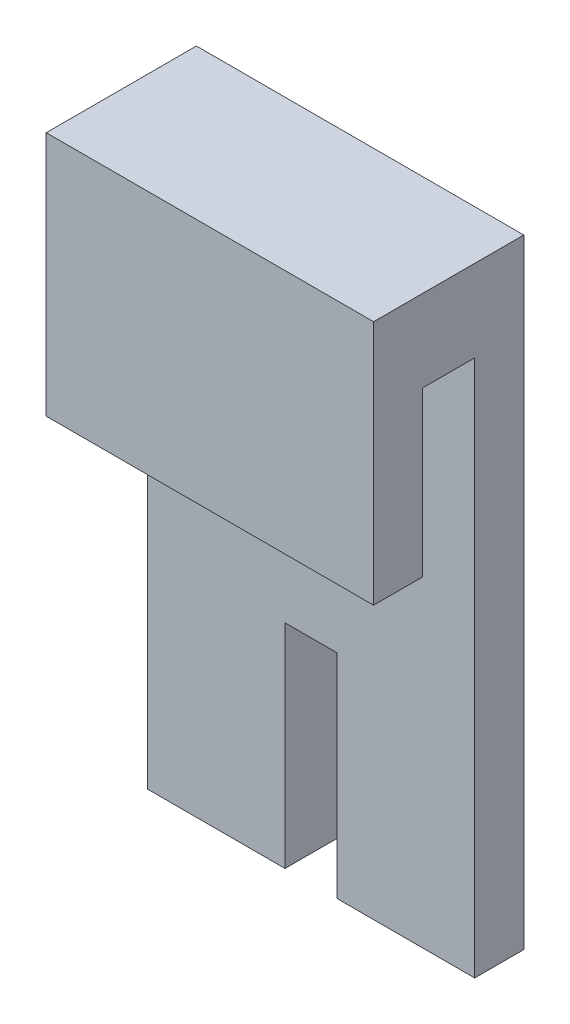
ISO-10303-21;
HEADER;
FILE_DESCRIPTION(('STEP AP214'),'2;1');
FILE_NAME('part.step','',(''),(''),'','','');
FILE_SCHEMA(('AUTOMOTIVE_DESIGN { 1 0 10303 214 1 1 1 1 }'));
ENDSEC;
DATA;
#1=APPLICATION_CONTEXT('core data for automotive mechanical design processes');
#2=APPLICATION_PROTOCOL_DEFINITION('international standard','automotive_design',2000,#1);
#3=PRODUCT_CONTEXT('',#1,'mechanical');
#4=PRODUCT('Part','Part','',(#3));
#5=PRODUCT_RELATED_PRODUCT_CATEGORY('part','',(#4));
#6=PRODUCT_DEFINITION_FORMATION('','',#4);
#7=PRODUCT_DEFINITION_CONTEXT('part definition',#1,'design');
#8=PRODUCT_DEFINITION('design','',#6,#7);
#9=PRODUCT_DEFINITION_SHAPE('','',#8);
#10=(LENGTH_UNIT() NAMED_UNIT(*) SI_UNIT(.MILLI.,.METRE.));
#11=(NAMED_UNIT(*) PLANE_ANGLE_UNIT() SI_UNIT($,.RADIAN.));
#12=(NAMED_UNIT(*) SI_UNIT($,.STERADIAN.) SOLID_ANGLE_UNIT());
#13=UNCERTAINTY_MEASURE_WITH_UNIT(LENGTH_MEASURE(1.E-05),#10,'distance_accuracy_value','');
#14=(GEOMETRIC_REPRESENTATION_CONTEXT(3) GLOBAL_UNCERTAINTY_ASSIGNED_CONTEXT((#13)) GLOBAL_UNIT_ASSIGNED_CONTEXT((#10,
#11,#12)) REPRESENTATION_CONTEXT('',''));
#15=CARTESIAN_POINT('',(0.,0.,0.));
#16=DIRECTION('',(0.,0.,1.));
#17=DIRECTION('',(1.,0.,0.));
#18=AXIS2_PLACEMENT_3D('',#15,#16,#17);
#19=CARTESIAN_POINT('',(20.,-22.812,-6.17500000000001));
#20=DIRECTION('',(0.,1.,0.));
#21=DIRECTION('',(0.,0.,1.));
#22=AXIS2_PLACEMENT_3D('',#19,#20,#21);
#23=PLANE('',#22);
#24=DIRECTION('',(0.,0.,1.));
#25=VECTOR('',#24,1.);
#26=CARTESIAN_POINT('',(8.4125,-22.812,-14.175));
#27=LINE('',#26,#25);
#28=CARTESIAN_POINT('',(8.4125,-22.812,-14.175));
#29=VERTEX_POINT('',#28);
#30=CARTESIAN_POINT('',(8.4125,-22.812,-6.17500000000001));
#31=VERTEX_POINT('',#30);
#32=EDGE_CURVE('E257',#29,#31,#27,.T.);
#33=ORIENTED_EDGE('',*,*,#32,.T.);
#34=DIRECTION('',(-1.,0.,0.));
#35=VECTOR('',#34,1.);
#36=CARTESIAN_POINT('',(20.,-22.812,-6.17500000000001));
#37=LINE('',#36,#35);
#38=CARTESIAN_POINT('',(0.,-22.812,-6.17500000000001));
#39=VERTEX_POINT('',#38);
#40=EDGE_CURVE('E176',#31,#39,#37,.T.);
#41=ORIENTED_EDGE('',*,*,#40,.T.);
#42=DIRECTION('',(0.,0.,-1.));
#43=VECTOR('',#42,1.);
#44=CARTESIAN_POINT('',(0.,-22.812,-6.17500000000001));
#45=LINE('',#44,#43);
#46=CARTESIAN_POINT('',(0.,-22.812,-9.17500000000001));
#47=VERTEX_POINT('',#46);
#48=EDGE_CURVE('E211',#39,#47,#45,.T.);
#49=ORIENTED_EDGE('',*,*,#48,.T.);
#50=DIRECTION('',(-1.,0.,0.));
#51=VECTOR('',#50,1.);
#52=CARTESIAN_POINT('',(20.,-22.812,-9.17500000000001));
#53=LINE('',#52,#51);
#54=CARTESIAN_POINT('',(5.4125,-22.812,-9.17500000000001));
#55=VERTEX_POINT('',#54);
#56=EDGE_CURVE('E224',#55,#47,#53,.T.);
#57=ORIENTED_EDGE('',*,*,#56,.F.);
#58=DIRECTION('',(0.,0.,1.));
#59=VECTOR('',#58,1.);
#60=CARTESIAN_POINT('',(5.4125,-22.812,-14.175));
#61=LINE('',#60,#59);
#62=CARTESIAN_POINT('',(5.4125,-22.812,-14.175));
#63=VERTEX_POINT('',#62);
#64=EDGE_CURVE('E254',#63,#55,#61,.T.);
#65=ORIENTED_EDGE('',*,*,#64,.F.);
#66=DIRECTION('',(-1.,0.,0.));
#67=VECTOR('',#66,1.);
#68=CARTESIAN_POINT('',(8.4125,-22.812,-14.175));
#69=LINE('',#68,#67);
#70=EDGE_CURVE('E302',#29,#63,#69,.T.);
#71=ORIENTED_EDGE('',*,*,#70,.F.);
#72=EDGE_LOOP('',(#33,#41,#49,#57,#65,#71));
#73=FACE_BOUND('',#72,.T.);
#74=ADVANCED_FACE('F35',(#73),#23,.F.);
#75=CARTESIAN_POINT('',(20.,-22.812,-9.17500000000001));
#76=DIRECTION('',(0.,0.,1.));
#77=DIRECTION('',(1.,0.,0.));
#78=AXIS2_PLACEMENT_3D('',#75,#76,#77);
#79=PLANE('',#78);
#80=DIRECTION('',(0.,-1.,0.));
#81=VECTOR('',#80,1.);
#82=CARTESIAN_POINT('',(14.5875,-6.81200000000001,-9.17500000000001));
#83=LINE('',#82,#81);
#84=CARTESIAN_POINT('',(14.5875,-6.81200000000001,-9.17500000000001));
#85=VERTEX_POINT('',#84);
#86=CARTESIAN_POINT('',(14.5875,-22.812,-9.17500000000001));
#87=VERTEX_POINT('',#86);
#88=EDGE_CURVE('E50',#85,#87,#83,.T.);
#89=ORIENTED_EDGE('',*,*,#88,.F.);
#90=DIRECTION('',(1.,0.,0.));
#91=VECTOR('',#90,1.);
#92=CARTESIAN_POINT('',(5.4125,-6.81200000000001,-9.17500000000001));
#93=LINE('',#92,#91);
#94=CARTESIAN_POINT('',(5.4125,-6.81200000000001,-9.17500000000001));
#95=VERTEX_POINT('',#94);
#96=EDGE_CURVE('E54',#95,#85,#93,.T.);
#97=ORIENTED_EDGE('',*,*,#96,.F.);
#98=DIRECTION('',(0.,1.,0.));
#99=VECTOR('',#98,1.);
#100=CARTESIAN_POINT('',(5.4125,-22.812,-9.17500000000001));
#101=LINE('',#100,#99);
#102=EDGE_CURVE('E170',#55,#95,#101,.T.);
#103=ORIENTED_EDGE('',*,*,#102,.F.);
#104=ORIENTED_EDGE('',*,*,#56,.T.);
#105=DIRECTION('',(0.,1.,0.));
#106=VECTOR('',#105,1.);
#107=CARTESIAN_POINT('',(0.,-22.812,-9.17500000000001));
#108=LINE('',#107,#106);
#109=CARTESIAN_POINT('',(0.,15.,-9.17500000000001));
#110=VERTEX_POINT('',#109);
#111=EDGE_CURVE('E214',#47,#110,#108,.T.);
#112=ORIENTED_EDGE('',*,*,#111,.T.);
#113=DIRECTION('',(-1.,0.,0.));
#114=VECTOR('',#113,1.);
#115=CARTESIAN_POINT('',(20.,15.,-9.17500000000001));
#116=LINE('',#115,#114);
#117=CARTESIAN_POINT('',(20.,15.,-9.17500000000001));
#118=VERTEX_POINT('',#117);
#119=EDGE_CURVE('E221',#118,#110,#116,.T.);
#120=ORIENTED_EDGE('',*,*,#119,.F.);
#121=DIRECTION('',(0.,1.,0.));
#122=VECTOR('',#121,1.);
#123=CARTESIAN_POINT('',(20.,-22.812,-9.17500000000001));
#124=LINE('',#123,#122);
#125=CARTESIAN_POINT('',(20.,-22.812,-9.17500000000001));
#126=VERTEX_POINT('',#125);
#127=EDGE_CURVE('E232',#126,#118,#124,.T.);
#128=ORIENTED_EDGE('',*,*,#127,.F.);
#129=EDGE_CURVE('E181',#126,#87,#53,.T.);
#130=ORIENTED_EDGE('',*,*,#129,.T.);
#131=EDGE_LOOP('',(#89,#97,#103,#104,#112,#120,#128,#130));
#132=FACE_BOUND('',#131,.T.);
#133=ADVANCED_FACE('F231',(#132),#79,.F.);
#134=CARTESIAN_POINT('',(20.,15.,0.));
#135=DIRECTION('',(0.,0.,-1.));
#136=DIRECTION('',(0.,1.,0.));
#137=AXIS2_PLACEMENT_3D('',#134,#135,#136);
#138=PLANE('',#137);
#139=DIRECTION('',(0.,-1.,0.));
#140=VECTOR('',#139,1.);
#141=CARTESIAN_POINT('',(0.,15.,0.));
#142=LINE('',#141,#140);
#143=CARTESIAN_POINT('',(0.,15.,0.));
#144=VERTEX_POINT('',#143);
#145=CARTESIAN_POINT('',(0.,0.,0.));
#146=VERTEX_POINT('',#145);
#147=EDGE_CURVE('E157',#144,#146,#142,.T.);
#148=ORIENTED_EDGE('',*,*,#147,.T.);
#149=DIRECTION('',(-1.,0.,0.));
#150=VECTOR('',#149,1.);
#151=CARTESIAN_POINT('',(20.,0.,0.));
#152=LINE('',#151,#150);
#153=CARTESIAN_POINT('',(20.,0.,0.));
#154=VERTEX_POINT('',#153);
#155=EDGE_CURVE('E11',#154,#146,#152,.T.);
#156=ORIENTED_EDGE('',*,*,#155,.F.);
#157=DIRECTION('',(0.,-1.,0.));
#158=VECTOR('',#157,1.);
#159=CARTESIAN_POINT('',(20.,15.,0.));
#160=LINE('',#159,#158);
#161=CARTESIAN_POINT('',(20.,15.,0.));
#162=VERTEX_POINT('',#161);
#163=EDGE_CURVE('E218',#162,#154,#160,.T.);
#164=ORIENTED_EDGE('',*,*,#163,.F.);
#165=DIRECTION('',(-1.,0.,0.));
#166=VECTOR('',#165,1.);
#167=CARTESIAN_POINT('',(20.,15.,0.));
#168=LINE('',#167,#166);
#169=EDGE_CURVE('E219',#162,#144,#168,.T.);
#170=ORIENTED_EDGE('',*,*,#169,.T.);
#171=EDGE_LOOP('',(#148,#156,#164,#170));
#172=FACE_BOUND('',#171,.T.);
#173=ADVANCED_FACE('F37',(#172),#138,.F.);
#174=CARTESIAN_POINT('',(20.,0.,0.));
#175=DIRECTION('',(0.,1.,0.));
#176=DIRECTION('',(0.,0.,1.));
#177=AXIS2_PLACEMENT_3D('',#174,#175,#176);
#178=PLANE('',#177);
#179=DIRECTION('',(0.,0.,-1.));
#180=VECTOR('',#179,1.);
#181=CARTESIAN_POINT('',(0.,0.,0.));
#182=LINE('',#181,#180);
#183=CARTESIAN_POINT('',(0.,0.,-3.));
#184=VERTEX_POINT('',#183);
#185=EDGE_CURVE('E200',#146,#184,#182,.T.);
#186=ORIENTED_EDGE('',*,*,#185,.T.);
#187=DIRECTION('',(-1.,0.,0.));
#188=VECTOR('',#187,1.);
#189=CARTESIAN_POINT('',(20.,0.,-3.));
#190=LINE('',#189,#188);
#191=CARTESIAN_POINT('',(20.,0.,-3.));
#192=VERTEX_POINT('',#191);
#193=EDGE_CURVE('E43',#192,#184,#190,.T.);
#194=ORIENTED_EDGE('',*,*,#193,.F.);
#195=DIRECTION('',(0.,0.,-1.));
#196=VECTOR('',#195,1.);
#197=CARTESIAN_POINT('',(20.,0.,0.));
#198=LINE('',#197,#196);
#199=EDGE_CURVE('E264',#154,#192,#198,.T.);
#200=ORIENTED_EDGE('',*,*,#199,.F.);
#201=ORIENTED_EDGE('',*,*,#155,.T.);
#202=EDGE_LOOP('',(#186,#194,#200,#201));
#203=FACE_BOUND('',#202,.T.);
#204=ADVANCED_FACE('F350',(#203),#178,.F.);
#205=CARTESIAN_POINT('',(20.,0.,-3.));
#206=DIRECTION('',(0.,0.,1.));
#207=DIRECTION('',(1.,0.,0.));
#208=AXIS2_PLACEMENT_3D('',#205,#206,#207);
#209=PLANE('',#208);
#210=DIRECTION('',(0.,1.,0.));
#211=VECTOR('',#210,1.);
#212=CARTESIAN_POINT('',(0.,0.,-3.));
#213=LINE('',#212,#211);
#214=CARTESIAN_POINT('',(0.,10.,-3.));
#215=VERTEX_POINT('',#214);
#216=EDGE_CURVE('E193',#184,#215,#213,.T.);
#217=ORIENTED_EDGE('',*,*,#216,.T.);
#218=DIRECTION('',(-1.,0.,0.));
#219=VECTOR('',#218,1.);
#220=CARTESIAN_POINT('',(20.,10.,-3.));
#221=LINE('',#220,#219);
#222=CARTESIAN_POINT('',(20.,10.,-3.));
#223=VERTEX_POINT('',#222);
#224=EDGE_CURVE('E179',#223,#215,#221,.T.);
#225=ORIENTED_EDGE('',*,*,#224,.F.);
#226=DIRECTION('',(0.,1.,0.));
#227=VECTOR('',#226,1.);
#228=CARTESIAN_POINT('',(20.,0.,-3.));
#229=LINE('',#228,#227);
#230=EDGE_CURVE('E194',#192,#223,#229,.T.);
#231=ORIENTED_EDGE('',*,*,#230,.F.);
#232=ORIENTED_EDGE('',*,*,#193,.T.);
#233=EDGE_LOOP('',(#217,#225,#231,#232));
#234=FACE_BOUND('',#233,.T.);
#235=ADVANCED_FACE('F191',(#234),#209,.F.);
#236=CARTESIAN_POINT('',(20.,10.,-3.));
#237=DIRECTION('',(0.,1.,0.));
#238=DIRECTION('',(0.,0.,1.));
#239=AXIS2_PLACEMENT_3D('',#236,#237,#238);
#240=PLANE('',#239);
#241=DIRECTION('',(0.,0.,-1.));
#242=VECTOR('',#241,1.);
#243=CARTESIAN_POINT('',(0.,10.,-3.));
#244=LINE('',#243,#242);
#245=CARTESIAN_POINT('',(0.,10.,-6.175));
#246=VERTEX_POINT('',#245);
#247=EDGE_CURVE('E202',#215,#246,#244,.T.);
#248=ORIENTED_EDGE('',*,*,#247,.T.);
#249=DIRECTION('',(-1.,0.,0.));
#250=VECTOR('',#249,1.);
#251=CARTESIAN_POINT('',(20.,10.,-6.175));
#252=LINE('',#251,#250);
#253=CARTESIAN_POINT('',(20.,10.,-6.175));
#254=VERTEX_POINT('',#253);
#255=EDGE_CURVE('E175',#254,#246,#252,.T.);
#256=ORIENTED_EDGE('',*,*,#255,.F.);
#257=DIRECTION('',(0.,0.,-1.));
#258=VECTOR('',#257,1.);
#259=CARTESIAN_POINT('',(20.,10.,-3.));
#260=LINE('',#259,#258);
#261=EDGE_CURVE('E267',#223,#254,#260,.T.);
#262=ORIENTED_EDGE('',*,*,#261,.F.);
#263=ORIENTED_EDGE('',*,*,#224,.T.);
#264=EDGE_LOOP('',(#248,#256,#262,#263));
#265=FACE_BOUND('',#264,.T.);
#266=ADVANCED_FACE('F343',(#265),#240,.F.);
#267=CARTESIAN_POINT('',(20.,10.,-6.175));
#268=DIRECTION('',(0.,0.,-1.));
#269=DIRECTION('',(0.,1.,0.));
#270=AXIS2_PLACEMENT_3D('',#267,#268,#269);
#271=PLANE('',#270);
#272=ORIENTED_EDGE('',*,*,#40,.F.);
#273=DIRECTION('',(0.,-1.,0.));
#274=VECTOR('',#273,1.);
#275=CARTESIAN_POINT('',(8.4125,-22.812,-6.17500000000001));
#276=LINE('',#275,#274);
#277=CARTESIAN_POINT('',(8.4125,-9.81199999999999,-6.175));
#278=VERTEX_POINT('',#277);
#279=EDGE_CURVE('E291',#278,#31,#276,.T.);
#280=ORIENTED_EDGE('',*,*,#279,.F.);
#281=DIRECTION('',(-1.,0.,0.));
#282=VECTOR('',#281,1.);
#283=CARTESIAN_POINT('',(8.4125,-9.81199999999999,-6.175));
#284=LINE('',#283,#282);
#285=CARTESIAN_POINT('',(11.5875,-9.81199999999999,-6.175));
#286=VERTEX_POINT('',#285);
#287=EDGE_CURVE('E169',#286,#278,#284,.T.);
#288=ORIENTED_EDGE('',*,*,#287,.F.);
#289=DIRECTION('',(0.,1.,0.));
#290=VECTOR('',#289,1.);
#291=CARTESIAN_POINT('',(11.5875,-9.81199999999999,-6.175));
#292=LINE('',#291,#290);
#293=CARTESIAN_POINT('',(11.5875,-22.812,-6.17500000000001));
#294=VERTEX_POINT('',#293);
#295=EDGE_CURVE('E150',#294,#286,#292,.T.);
#296=ORIENTED_EDGE('',*,*,#295,.F.);
#297=CARTESIAN_POINT('',(20.,-22.812,-6.17500000000001));
#298=VERTEX_POINT('',#297);
#299=EDGE_CURVE('E165',#298,#294,#37,.T.);
#300=ORIENTED_EDGE('',*,*,#299,.F.);
#301=DIRECTION('',(0.,-1.,0.));
#302=VECTOR('',#301,1.);
#303=CARTESIAN_POINT('',(20.,10.,-6.175));
#304=LINE('',#303,#302);
#305=EDGE_CURVE('E269',#254,#298,#304,.T.);
#306=ORIENTED_EDGE('',*,*,#305,.F.);
#307=ORIENTED_EDGE('',*,*,#255,.T.);
#308=DIRECTION('',(0.,-1.,0.));
#309=VECTOR('',#308,1.);
#310=CARTESIAN_POINT('',(0.,10.,-6.175));
#311=LINE('',#310,#309);
#312=EDGE_CURVE('E204',#246,#39,#311,.T.);
#313=ORIENTED_EDGE('',*,*,#312,.T.);
#314=EDGE_LOOP('',(#272,#280,#288,#296,#300,#306,#307,#313));
#315=FACE_BOUND('',#314,.T.);
#316=ADVANCED_FACE('F163',(#315),#271,.F.);
#317=ORIENTED_EDGE('',*,*,#299,.T.);
#318=DIRECTION('',(0.,0.,1.));
#319=VECTOR('',#318,1.);
#320=CARTESIAN_POINT('',(11.5875,-22.812,-14.175));
#321=LINE('',#320,#319);
#322=CARTESIAN_POINT('',(11.5875,-22.812,-14.175));
#323=VERTEX_POINT('',#322);
#324=EDGE_CURVE('E146',#323,#294,#321,.T.);
#325=ORIENTED_EDGE('',*,*,#324,.F.);
#326=DIRECTION('',(-1.,0.,0.));
#327=VECTOR('',#326,1.);
#328=CARTESIAN_POINT('',(14.5875,-22.812,-14.175));
#329=LINE('',#328,#327);
#330=CARTESIAN_POINT('',(14.5875,-22.812,-14.175));
#331=VERTEX_POINT('',#330);
#332=EDGE_CURVE('E242',#331,#323,#329,.T.);
#333=ORIENTED_EDGE('',*,*,#332,.F.);
#334=DIRECTION('',(0.,0.,1.));
#335=VECTOR('',#334,1.);
#336=CARTESIAN_POINT('',(14.5875,-22.812,-14.175));
#337=LINE('',#336,#335);
#338=EDGE_CURVE('E239',#331,#87,#337,.T.);
#339=ORIENTED_EDGE('',*,*,#338,.T.);
#340=ORIENTED_EDGE('',*,*,#129,.F.);
#341=DIRECTION('',(0.,0.,-1.));
#342=VECTOR('',#341,1.);
#343=CARTESIAN_POINT('',(20.,-22.812,-6.17500000000001));
#344=LINE('',#343,#342);
#345=EDGE_CURVE('E174',#298,#126,#344,.T.);
#346=ORIENTED_EDGE('',*,*,#345,.F.);
#347=EDGE_LOOP('',(#317,#325,#333,#339,#340,#346));
#348=FACE_BOUND('',#347,.T.);
#349=ADVANCED_FACE('F172',(#348),#23,.F.);
#350=CARTESIAN_POINT('',(20.,15.,-9.17500000000001));
#351=DIRECTION('',(0.,-1.,0.));
#352=DIRECTION('',(0.,0.,-1.));
#353=AXIS2_PLACEMENT_3D('',#350,#351,#352);
#354=PLANE('',#353);
#355=DIRECTION('',(0.,0.,1.));
#356=VECTOR('',#355,1.);
#357=CARTESIAN_POINT('',(0.,15.,-9.17500000000001));
#358=LINE('',#357,#356);
#359=EDGE_CURVE('E216',#110,#144,#358,.T.);
#360=ORIENTED_EDGE('',*,*,#359,.T.);
#361=ORIENTED_EDGE('',*,*,#169,.F.);
#362=DIRECTION('',(0.,0.,1.));
#363=VECTOR('',#362,1.);
#364=CARTESIAN_POINT('',(20.,15.,-9.17500000000001));
#365=LINE('',#364,#363);
#366=EDGE_CURVE('E222',#118,#162,#365,.T.);
#367=ORIENTED_EDGE('',*,*,#366,.F.);
#368=ORIENTED_EDGE('',*,*,#119,.T.);
#369=EDGE_LOOP('',(#360,#361,#367,#368));
#370=FACE_BOUND('',#369,.T.);
#371=ADVANCED_FACE('F280',(#370),#354,.F.);
#372=CARTESIAN_POINT('',(20.,0.,0.));
#373=DIRECTION('',(1.,0.,0.));
#374=DIRECTION('',(0.,0.,-1.));
#375=AXIS2_PLACEMENT_3D('',#372,#373,#374);
#376=PLANE('',#375);
#377=ORIENTED_EDGE('',*,*,#163,.T.);
#378=ORIENTED_EDGE('',*,*,#199,.T.);
#379=ORIENTED_EDGE('',*,*,#230,.T.);
#380=ORIENTED_EDGE('',*,*,#261,.T.);
#381=ORIENTED_EDGE('',*,*,#305,.T.);
#382=ORIENTED_EDGE('',*,*,#345,.T.);
#383=ORIENTED_EDGE('',*,*,#127,.T.);
#384=ORIENTED_EDGE('',*,*,#366,.T.);
#385=EDGE_LOOP('',(#377,#378,#379,#380,#381,#382,#383,#384));
#386=FACE_BOUND('',#385,.T.);
#387=ADVANCED_FACE('F282',(#386),#376,.T.);
#388=CARTESIAN_POINT('',(0.,0.,0.));
#389=DIRECTION('',(1.,0.,0.));
#390=DIRECTION('',(0.,0.,-1.));
#391=AXIS2_PLACEMENT_3D('',#388,#389,#390);
#392=PLANE('',#391);
#393=ORIENTED_EDGE('',*,*,#147,.F.);
#394=ORIENTED_EDGE('',*,*,#359,.F.);
#395=ORIENTED_EDGE('',*,*,#111,.F.);
#396=ORIENTED_EDGE('',*,*,#48,.F.);
#397=ORIENTED_EDGE('',*,*,#312,.F.);
#398=ORIENTED_EDGE('',*,*,#247,.F.);
#399=ORIENTED_EDGE('',*,*,#216,.F.);
#400=ORIENTED_EDGE('',*,*,#185,.F.);
#401=EDGE_LOOP('',(#393,#394,#395,#396,#397,#398,#399,#400));
#402=FACE_BOUND('',#401,.T.);
#403=ADVANCED_FACE('F199',(#402),#392,.F.);
#404=CARTESIAN_POINT('',(11.5875,-22.812,-14.175));
#405=DIRECTION('',(1.,0.,0.));
#406=DIRECTION('',(0.,0.,-1.));
#407=AXIS2_PLACEMENT_3D('',#404,#405,#406);
#408=PLANE('',#407);
#409=ORIENTED_EDGE('',*,*,#324,.T.);
#410=ORIENTED_EDGE('',*,*,#295,.T.);
#411=DIRECTION('',(0.,0.,1.));
#412=VECTOR('',#411,1.);
#413=CARTESIAN_POINT('',(11.5875,-9.81199999999999,-14.175));
#414=LINE('',#413,#412);
#415=CARTESIAN_POINT('',(11.5875,-9.81199999999999,-14.175));
#416=VERTEX_POINT('',#415);
#417=EDGE_CURVE('E158',#416,#286,#414,.T.);
#418=ORIENTED_EDGE('',*,*,#417,.F.);
#419=DIRECTION('',(0.,1.,0.));
#420=VECTOR('',#419,1.);
#421=CARTESIAN_POINT('',(11.5875,-22.812,-14.175));
#422=LINE('',#421,#420);
#423=EDGE_CURVE('E152',#323,#416,#422,.T.);
#424=ORIENTED_EDGE('',*,*,#423,.F.);
#425=EDGE_LOOP('',(#409,#410,#418,#424));
#426=FACE_BOUND('',#425,.T.);
#427=ADVANCED_FACE('F148',(#426),#408,.F.);
#428=CARTESIAN_POINT('',(11.5875,-9.81199999999999,-14.175));
#429=DIRECTION('',(0.,1.,0.));
#430=DIRECTION('',(0.,0.,1.));
#431=AXIS2_PLACEMENT_3D('',#428,#429,#430);
#432=PLANE('',#431);
#433=ORIENTED_EDGE('',*,*,#417,.T.);
#434=ORIENTED_EDGE('',*,*,#287,.T.);
#435=DIRECTION('',(0.,0.,1.));
#436=VECTOR('',#435,1.);
#437=CARTESIAN_POINT('',(8.4125,-9.81199999999999,-14.175));
#438=LINE('',#437,#436);
#439=CARTESIAN_POINT('',(8.4125,-9.81199999999999,-14.175));
#440=VERTEX_POINT('',#439);
#441=EDGE_CURVE('E259',#440,#278,#438,.T.);
#442=ORIENTED_EDGE('',*,*,#441,.F.);
#443=DIRECTION('',(-1.,0.,0.));
#444=VECTOR('',#443,1.);
#445=CARTESIAN_POINT('',(11.5875,-9.81199999999999,-14.175));
#446=LINE('',#445,#444);
#447=EDGE_CURVE('E298',#416,#440,#446,.T.);
#448=ORIENTED_EDGE('',*,*,#447,.F.);
#449=EDGE_LOOP('',(#433,#434,#442,#448));
#450=FACE_BOUND('',#449,.T.);
#451=ADVANCED_FACE('F321',(#450),#432,.F.);
#452=CARTESIAN_POINT('',(8.4125,-9.81199999999999,-14.175));
#453=DIRECTION('',(-1.,0.,0.));
#454=DIRECTION('',(0.,0.,1.));
#455=AXIS2_PLACEMENT_3D('',#452,#453,#454);
#456=PLANE('',#455);
#457=ORIENTED_EDGE('',*,*,#441,.T.);
#458=ORIENTED_EDGE('',*,*,#279,.T.);
#459=ORIENTED_EDGE('',*,*,#32,.F.);
#460=DIRECTION('',(0.,-1.,0.));
#461=VECTOR('',#460,1.);
#462=CARTESIAN_POINT('',(8.4125,-9.81199999999999,-14.175));
#463=LINE('',#462,#461);
#464=EDGE_CURVE('E300',#440,#29,#463,.T.);
#465=ORIENTED_EDGE('',*,*,#464,.F.);
#466=EDGE_LOOP('',(#457,#458,#459,#465));
#467=FACE_BOUND('',#466,.T.);
#468=ADVANCED_FACE('F319',(#467),#456,.F.);
#469=CARTESIAN_POINT('',(5.4125,-22.812,-14.175));
#470=DIRECTION('',(1.,0.,0.));
#471=DIRECTION('',(0.,0.,-1.));
#472=AXIS2_PLACEMENT_3D('',#469,#470,#471);
#473=PLANE('',#472);
#474=ORIENTED_EDGE('',*,*,#102,.T.);
#475=DIRECTION('',(0.,0.,1.));
#476=VECTOR('',#475,1.);
#477=CARTESIAN_POINT('',(5.4125,-6.81200000000001,-14.175));
#478=LINE('',#477,#476);
#479=CARTESIAN_POINT('',(5.4125,-6.81200000000001,-14.175));
#480=VERTEX_POINT('',#479);
#481=EDGE_CURVE('E246',#480,#95,#478,.T.);
#482=ORIENTED_EDGE('',*,*,#481,.F.);
#483=DIRECTION('',(0.,1.,0.));
#484=VECTOR('',#483,1.);
#485=CARTESIAN_POINT('',(5.4125,-22.812,-14.175));
#486=LINE('',#485,#484);
#487=EDGE_CURVE('E304',#63,#480,#486,.T.);
#488=ORIENTED_EDGE('',*,*,#487,.F.);
#489=ORIENTED_EDGE('',*,*,#64,.T.);
#490=EDGE_LOOP('',(#474,#482,#488,#489));
#491=FACE_BOUND('',#490,.T.);
#492=ADVANCED_FACE('F313',(#491),#473,.F.);
#493=CARTESIAN_POINT('',(5.4125,-6.81200000000001,-14.175));
#494=DIRECTION('',(0.,-1.,0.));
#495=DIRECTION('',(1.,0.,0.));
#496=AXIS2_PLACEMENT_3D('',#493,#494,#495);
#497=PLANE('',#496);
#498=ORIENTED_EDGE('',*,*,#96,.T.);
#499=DIRECTION('',(0.,0.,1.));
#500=VECTOR('',#499,1.);
#501=CARTESIAN_POINT('',(14.5875,-6.81200000000001,-14.175));
#502=LINE('',#501,#500);
#503=CARTESIAN_POINT('',(14.5875,-6.81200000000001,-14.175));
#504=VERTEX_POINT('',#503);
#505=EDGE_CURVE('E241',#504,#85,#502,.T.);
#506=ORIENTED_EDGE('',*,*,#505,.F.);
#507=DIRECTION('',(1.,0.,0.));
#508=VECTOR('',#507,1.);
#509=CARTESIAN_POINT('',(5.4125,-6.81200000000001,-14.175));
#510=LINE('',#509,#508);
#511=EDGE_CURVE('E248',#480,#504,#510,.T.);
#512=ORIENTED_EDGE('',*,*,#511,.F.);
#513=ORIENTED_EDGE('',*,*,#481,.T.);
#514=EDGE_LOOP('',(#498,#506,#512,#513));
#515=FACE_BOUND('',#514,.T.);
#516=ADVANCED_FACE('F308',(#515),#497,.F.);
#517=CARTESIAN_POINT('',(14.5875,-6.81200000000001,-14.175));
#518=DIRECTION('',(-1.,0.,0.));
#519=DIRECTION('',(0.,-1.,0.));
#520=AXIS2_PLACEMENT_3D('',#517,#518,#519);
#521=PLANE('',#520);
#522=ORIENTED_EDGE('',*,*,#88,.T.);
#523=ORIENTED_EDGE('',*,*,#338,.F.);
#524=DIRECTION('',(0.,-1.,0.));
#525=VECTOR('',#524,1.);
#526=CARTESIAN_POINT('',(14.5875,-6.81200000000001,-14.175));
#527=LINE('',#526,#525);
#528=EDGE_CURVE('E244',#504,#331,#527,.T.);
#529=ORIENTED_EDGE('',*,*,#528,.F.);
#530=ORIENTED_EDGE('',*,*,#505,.T.);
#531=EDGE_LOOP('',(#522,#523,#529,#530));
#532=FACE_BOUND('',#531,.T.);
#533=ADVANCED_FACE('F237',(#532),#521,.F.);
#534=CARTESIAN_POINT('',(0.,0.,-14.175));
#535=DIRECTION('',(0.,0.,-1.));
#536=DIRECTION('',(-1.,0.,0.));
#537=AXIS2_PLACEMENT_3D('',#534,#535,#536);
#538=PLANE('',#537);
#539=ORIENTED_EDGE('',*,*,#332,.T.);
#540=ORIENTED_EDGE('',*,*,#423,.T.);
#541=ORIENTED_EDGE('',*,*,#447,.T.);
#542=ORIENTED_EDGE('',*,*,#464,.T.);
#543=ORIENTED_EDGE('',*,*,#70,.T.);
#544=ORIENTED_EDGE('',*,*,#487,.T.);
#545=ORIENTED_EDGE('',*,*,#511,.T.);
#546=ORIENTED_EDGE('',*,*,#528,.T.);
#547=EDGE_LOOP('',(#539,#540,#541,#542,#543,#544,#545,#546));
#548=FACE_BOUND('',#547,.T.);
#549=ADVANCED_FACE('F315',(#548),#538,.T.);
#550=CLOSED_SHELL('',(#74,#133,#173,#204,#235,#266,#316,#349,#371,#387,#403,#427,#451,#468,#492,
#516,#533,#549));
#551=MANIFOLD_SOLID_BREP('B2',#550);
#552=ADVANCED_BREP_SHAPE_REPRESENTATION('',(#18,#551),#14);
#553=SHAPE_DEFINITION_REPRESENTATION(#9,#552);
ENDSEC;
END-ISO-10303-21;
